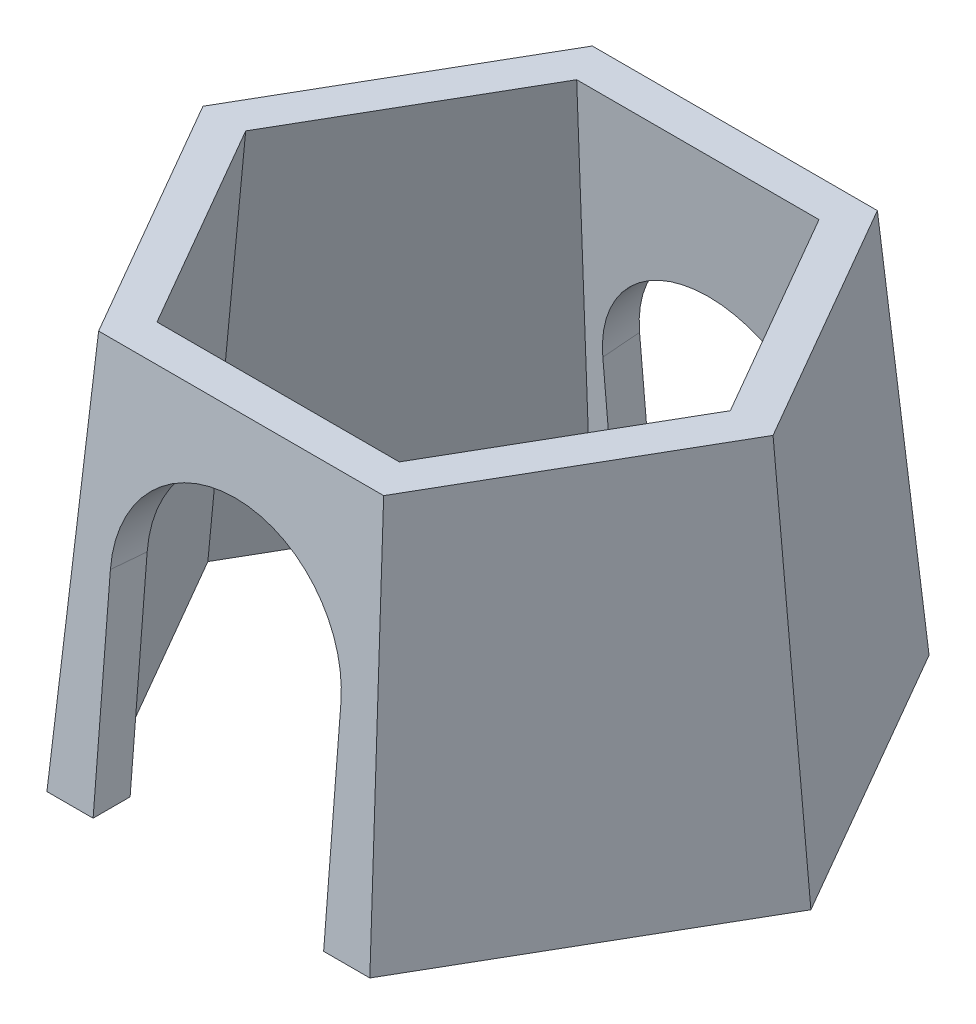
ISO-10303-21;
HEADER;
FILE_DESCRIPTION(('STEP AP214'),'2;1');
FILE_NAME('part.step','',(''),(''),'','','');
FILE_SCHEMA(('AUTOMOTIVE_DESIGN { 1 0 10303 214 1 1 1 1 }'));
ENDSEC;
DATA;
#1=APPLICATION_CONTEXT('core data for automotive mechanical design processes');
#2=APPLICATION_PROTOCOL_DEFINITION('international standard','automotive_design',2000,#1);
#3=PRODUCT_CONTEXT('',#1,'mechanical');
#4=PRODUCT('Part','Part','',(#3));
#5=PRODUCT_RELATED_PRODUCT_CATEGORY('part','',(#4));
#6=PRODUCT_DEFINITION_FORMATION('','',#4);
#7=PRODUCT_DEFINITION_CONTEXT('part definition',#1,'design');
#8=PRODUCT_DEFINITION('design','',#6,#7);
#9=PRODUCT_DEFINITION_SHAPE('','',#8);
#10=(LENGTH_UNIT() NAMED_UNIT(*) SI_UNIT(.MILLI.,.METRE.));
#11=(NAMED_UNIT(*) PLANE_ANGLE_UNIT() SI_UNIT($,.RADIAN.));
#12=(NAMED_UNIT(*) SI_UNIT($,.STERADIAN.) SOLID_ANGLE_UNIT());
#13=UNCERTAINTY_MEASURE_WITH_UNIT(LENGTH_MEASURE(1.E-05),#10,'distance_accuracy_value','');
#14=(GEOMETRIC_REPRESENTATION_CONTEXT(3) GLOBAL_UNCERTAINTY_ASSIGNED_CONTEXT((#13)) GLOBAL_UNIT_ASSIGNED_CONTEXT((#10,
#11,#12)) REPRESENTATION_CONTEXT('',''));
#15=CARTESIAN_POINT('',(0.,0.,0.));
#16=DIRECTION('',(0.,0.,1.));
#17=DIRECTION('',(1.,0.,0.));
#18=AXIS2_PLACEMENT_3D('',#15,#16,#17);
#19=CARTESIAN_POINT('',(0.,115.,0.));
#20=DIRECTION('',(0.,1.,0.));
#21=DIRECTION('',(0.,0.,1.));
#22=AXIS2_PLACEMENT_3D('',#19,#20,#21);
#23=PLANE('',#22);
#24=DIRECTION('',(0.,0.,-1.));
#25=VECTOR('',#24,1.);
#26=CARTESIAN_POINT('',(25.,115.,0.));
#27=LINE('',#26,#25);
#28=CARTESIAN_POINT('',(25.,115.,60.6497063949803));
#29=VERTEX_POINT('',#28);
#30=CARTESIAN_POINT('',(25.,115.,52.6217782649107));
#31=VERTEX_POINT('',#30);
#32=EDGE_CURVE('E435',#29,#31,#27,.T.);
#33=ORIENTED_EDGE('',*,*,#32,.T.);
#34=DIRECTION('',(1.,0.,0.));
#35=VECTOR('',#34,1.);
#36=CARTESIAN_POINT('',(-30.381197846483,115.,52.6217782649107));
#37=LINE('',#36,#35);
#38=CARTESIAN_POINT('',(30.381197846483,115.,52.6217782649107));
#39=VERTEX_POINT('',#38);
#40=EDGE_CURVE('E350',#31,#39,#37,.T.);
#41=ORIENTED_EDGE('',*,*,#40,.T.);
#42=DIRECTION('',(0.499999999999999,0.,-0.866025403784439));
#43=VECTOR('',#42,1.);
#44=CARTESIAN_POINT('',(30.381197846483,115.,52.6217782649107));
#45=LINE('',#44,#43);
#46=CARTESIAN_POINT('',(60.7623956929659,115.,0.));
#47=VERTEX_POINT('',#46);
#48=EDGE_CURVE('E340',#39,#47,#45,.T.);
#49=ORIENTED_EDGE('',*,*,#48,.T.);
#50=DIRECTION('',(-0.5,0.,-0.866025403784438));
#51=VECTOR('',#50,1.);
#52=CARTESIAN_POINT('',(60.7623956929659,115.,0.));
#53=LINE('',#52,#51);
#54=CARTESIAN_POINT('',(30.3811978464829,115.,-52.6217782649107));
#55=VERTEX_POINT('',#54);
#56=EDGE_CURVE('E335',#47,#55,#53,.T.);
#57=ORIENTED_EDGE('',*,*,#56,.T.);
#58=DIRECTION('',(-1.,0.,0.));
#59=VECTOR('',#58,1.);
#60=CARTESIAN_POINT('',(30.3811978464829,115.,-52.6217782649107));
#61=LINE('',#60,#59);
#62=CARTESIAN_POINT('',(24.8905136624591,115.,-52.6217782649107));
#63=VERTEX_POINT('',#62);
#64=EDGE_CURVE('E334',#55,#63,#61,.T.);
#65=ORIENTED_EDGE('',*,*,#64,.T.);
#66=DIRECTION('',(0.,0.,-1.));
#67=VECTOR('',#66,1.);
#68=CARTESIAN_POINT('',(24.8905136624591,115.,0.));
#69=LINE('',#68,#67);
#70=CARTESIAN_POINT('',(24.8905136624591,115.,-60.6497063949804));
#71=VERTEX_POINT('',#70);
#72=EDGE_CURVE('E495',#63,#71,#69,.T.);
#73=ORIENTED_EDGE('',*,*,#72,.T.);
#74=DIRECTION('',(-1.,0.,0.));
#75=VECTOR('',#74,1.);
#76=CARTESIAN_POINT('',(0.,115.,-60.6497063949803));
#77=LINE('',#76,#75);
#78=CARTESIAN_POINT('',(35.0161243134136,115.,-60.6497063949803));
#79=VERTEX_POINT('',#78);
#80=EDGE_CURVE('E412',#79,#71,#77,.T.);
#81=ORIENTED_EDGE('',*,*,#80,.F.);
#82=DIRECTION('',(-0.5,0.,-0.866025403784438));
#83=VECTOR('',#82,1.);
#84=CARTESIAN_POINT('',(52.5241864701205,115.,-30.3248531974902));
#85=LINE('',#84,#83);
#86=CARTESIAN_POINT('',(70.0322486268273,115.,0.));
#87=VERTEX_POINT('',#86);
#88=EDGE_CURVE('E415',#87,#79,#85,.T.);
#89=ORIENTED_EDGE('',*,*,#88,.F.);
#90=DIRECTION('',(0.5,0.,-0.866025403784439));
#91=VECTOR('',#90,1.);
#92=CARTESIAN_POINT('',(52.5241864701205,115.,30.3248531974901));
#93=LINE('',#92,#91);
#94=CARTESIAN_POINT('',(35.0161243134136,115.,60.6497063949803));
#95=VERTEX_POINT('',#94);
#96=EDGE_CURVE('E354',#95,#87,#93,.T.);
#97=ORIENTED_EDGE('',*,*,#96,.F.);
#98=DIRECTION('',(1.,0.,0.));
#99=VECTOR('',#98,1.);
#100=CARTESIAN_POINT('',(0.,115.,60.6497063949803));
#101=LINE('',#100,#99);
#102=EDGE_CURVE('E405',#29,#95,#101,.T.);
#103=ORIENTED_EDGE('',*,*,#102,.F.);
#104=EDGE_LOOP('',(#33,#41,#49,#57,#65,#73,#81,#89,#97,#103));
#105=FACE_BOUND('',#104,.T.);
#106=ADVANCED_FACE('F171',(#105),#23,.F.);
#107=CARTESIAN_POINT('',(-30.3811978464826,115.,52.6217782649113));
#108=VERTEX_POINT('',#107);
#109=CARTESIAN_POINT('',(-25.,115.,52.6217782649107));
#110=VERTEX_POINT('',#109);
#111=EDGE_CURVE('E353',#108,#110,#37,.T.);
#112=ORIENTED_EDGE('',*,*,#111,.T.);
#113=DIRECTION('',(0.,0.,1.));
#114=VECTOR('',#113,1.);
#115=CARTESIAN_POINT('',(-25.,115.,0.));
#116=LINE('',#115,#114);
#117=CARTESIAN_POINT('',(-25.,115.,60.6497063949804));
#118=VERTEX_POINT('',#117);
#119=EDGE_CURVE('E377',#110,#118,#116,.T.);
#120=ORIENTED_EDGE('',*,*,#119,.T.);
#121=CARTESIAN_POINT('',(-35.0161243134136,115.,60.6497063949803));
#122=VERTEX_POINT('',#121);
#123=EDGE_CURVE('E402',#122,#118,#101,.T.);
#124=ORIENTED_EDGE('',*,*,#123,.F.);
#125=DIRECTION('',(0.5,0.,0.866025403784438));
#126=VECTOR('',#125,1.);
#127=CARTESIAN_POINT('',(-52.5241864701204,115.,30.3248531974902));
#128=LINE('',#127,#126);
#129=CARTESIAN_POINT('',(-70.0322486268273,115.,0.));
#130=VERTEX_POINT('',#129);
#131=EDGE_CURVE('E406',#130,#122,#128,.T.);
#132=ORIENTED_EDGE('',*,*,#131,.F.);
#133=DIRECTION('',(-0.5,0.,0.866025403784439));
#134=VECTOR('',#133,1.);
#135=CARTESIAN_POINT('',(-52.5241864701204,115.,-30.3248531974901));
#136=LINE('',#135,#134);
#137=CARTESIAN_POINT('',(-35.0161243134136,115.,-60.6497063949803));
#138=VERTEX_POINT('',#137);
#139=EDGE_CURVE('E409',#138,#130,#136,.T.);
#140=ORIENTED_EDGE('',*,*,#139,.F.);
#141=CARTESIAN_POINT('',(-25.1094863375409,115.,-60.6497063949803));
#142=VERTEX_POINT('',#141);
#143=EDGE_CURVE('E314',#142,#138,#77,.T.);
#144=ORIENTED_EDGE('',*,*,#143,.F.);
#145=DIRECTION('',(0.,0.,1.));
#146=VECTOR('',#145,1.);
#147=CARTESIAN_POINT('',(-25.1094863375409,115.,0.));
#148=LINE('',#147,#146);
#149=CARTESIAN_POINT('',(-25.1094863375409,115.,-52.6217782649107));
#150=VERTEX_POINT('',#149);
#151=EDGE_CURVE('E306',#142,#150,#148,.T.);
#152=ORIENTED_EDGE('',*,*,#151,.T.);
#153=CARTESIAN_POINT('',(-30.3811978464837,115.,-52.6217782649107));
#154=VERTEX_POINT('',#153);
#155=EDGE_CURVE('E311',#150,#154,#61,.T.);
#156=ORIENTED_EDGE('',*,*,#155,.T.);
#157=DIRECTION('',(-0.5,0.,0.866025403784439));
#158=VECTOR('',#157,1.);
#159=CARTESIAN_POINT('',(-30.381197846483,115.,-52.6217782649107));
#160=LINE('',#159,#158);
#161=CARTESIAN_POINT('',(-60.7623956929663,115.,6.48786580015326E-13));
#162=VERTEX_POINT('',#161);
#163=EDGE_CURVE('E338',#154,#162,#160,.T.);
#164=ORIENTED_EDGE('',*,*,#163,.T.);
#165=DIRECTION('',(0.5,0.,0.866025403784439));
#166=VECTOR('',#165,1.);
#167=CARTESIAN_POINT('',(-60.762395692966,115.,0.));
#168=LINE('',#167,#166);
#169=EDGE_CURVE('E359',#162,#108,#168,.T.);
#170=ORIENTED_EDGE('',*,*,#169,.T.);
#171=EDGE_LOOP('',(#112,#120,#124,#132,#140,#144,#152,#156,#164,#170));
#172=FACE_BOUND('',#171,.T.);
#173=ADVANCED_FACE('F309',(#172),#23,.F.);
#174=CARTESIAN_POINT('',(0.,5.83574179699663,69.7792717812525));
#175=DIRECTION('',(0.,-0.0833405086202502,-0.996521128538135));
#176=DIRECTION('',(0.,0.996521128538135,-0.0833405086202502));
#177=AXIS2_PLACEMENT_3D('',#174,#175,#176);
#178=PLANE('',#177);
#179=DIRECTION('',(-0.0480610614431169,0.995369548204004,-0.0832442002851682));
#180=VECTOR('',#179,1.);
#181=CARTESIAN_POINT('',(40.1940236023456,7.76301602348197,69.6180910398851));
#182=LINE('',#181,#180);
#183=CARTESIAN_POINT('',(30.9119298159669,200.,53.5410330012579));
#184=VERTEX_POINT('',#183);
#185=EDGE_CURVE('E400',#95,#184,#182,.T.);
#186=ORIENTED_EDGE('',*,*,#185,.T.);
#187=DIRECTION('',(-1.,0.,0.));
#188=VECTOR('',#187,1.);
#189=CARTESIAN_POINT('',(0.,200.,53.5410330012579));
#190=LINE('',#189,#188);
#191=CARTESIAN_POINT('',(-30.9119298159669,200.,53.5410330012579));
#192=VERTEX_POINT('',#191);
#193=EDGE_CURVE('E483',#184,#192,#190,.T.);
#194=ORIENTED_EDGE('',*,*,#193,.T.);
#195=DIRECTION('',(0.0480610614431169,0.995369548204004,-0.0832442002851682));
#196=VECTOR('',#195,1.);
#197=CARTESIAN_POINT('',(-40.1940236023455,7.76301602348197,69.6180910398851));
#198=LINE('',#197,#196);
#199=EDGE_CURVE('E418',#122,#192,#198,.T.);
#200=ORIENTED_EDGE('',*,*,#199,.F.);
#201=ORIENTED_EDGE('',*,*,#123,.T.);
#202=DIRECTION('',(0.,-0.996521128538135,0.0833405086202502));
#203=VECTOR('',#202,1.);
#204=CARTESIAN_POINT('',(-25.,115.,60.6497063949804));
#205=LINE('',#204,#203);
#206=CARTESIAN_POINT('',(-25.,159.843450784216,56.8993835070691));
#207=VERTEX_POINT('',#206);
#208=EDGE_CURVE('E318',#207,#118,#205,.T.);
#209=ORIENTED_EDGE('',*,*,#208,.F.);
#210=CARTESIAN_POINT('',(0.,159.843450784216,56.8993835070691));
#211=DIRECTION('',(0.,0.0833405086202502,0.996521128538135));
#212=DIRECTION('',(0.,0.996521128538135,-0.0833405086202502));
#213=AXIS2_PLACEMENT_3D('',#210,#211,#212);
#214=CIRCLE('',#213,25.);
#215=CARTESIAN_POINT('',(25.,159.843450784216,56.8993835070691));
#216=VERTEX_POINT('',#215);
#217=EDGE_CURVE('E504',#216,#207,#214,.T.);
#218=ORIENTED_EDGE('',*,*,#217,.F.);
#219=DIRECTION('',(0.,0.996521128538135,-0.0833405086202502));
#220=VECTOR('',#219,1.);
#221=CARTESIAN_POINT('',(25.,115.,60.6497063949804));
#222=LINE('',#221,#220);
#223=EDGE_CURVE('E501',#29,#216,#222,.T.);
#224=ORIENTED_EDGE('',*,*,#223,.F.);
#225=ORIENTED_EDGE('',*,*,#102,.T.);
#226=EDGE_LOOP('',(#186,#194,#200,#201,#209,#218,#224,#225));
#227=FACE_BOUND('',#226,.T.);
#228=ADVANCED_FACE('F553',(#227),#178,.F.);
#229=CARTESIAN_POINT('',(-60.4306220201432,5.83574179699663,34.8896358906263));
#230=DIRECTION('',(0.863012612721963,-0.0833405086202502,-0.498260564269068));
#231=DIRECTION('',(-0.5,0.,-0.866025403784438));
#232=AXIS2_PLACEMENT_3D('',#229,#230,#231);
#233=PLANE('',#232);
#234=ORIENTED_EDGE('',*,*,#199,.T.);
#235=DIRECTION('',(-0.5,0.,-0.866025403784438));
#236=VECTOR('',#235,1.);
#237=CARTESIAN_POINT('',(-46.3678947239503,200.,26.770516500629));
#238=LINE('',#237,#236);
#239=CARTESIAN_POINT('',(-61.8238596319338,200.,0.));
#240=VERTEX_POINT('',#239);
#241=EDGE_CURVE('E480',#192,#240,#238,.T.);
#242=ORIENTED_EDGE('',*,*,#241,.T.);
#243=DIRECTION('',(0.0961221228862338,0.995369548204004,0.));
#244=VECTOR('',#243,1.);
#245=CARTESIAN_POINT('',(-80.3880472046911,7.76301602348196,0.));
#246=LINE('',#245,#244);
#247=EDGE_CURVE('E390',#130,#240,#246,.T.);
#248=ORIENTED_EDGE('',*,*,#247,.F.);
#249=ORIENTED_EDGE('',*,*,#131,.T.);
#250=EDGE_LOOP('',(#234,#242,#248,#249));
#251=FACE_BOUND('',#250,.T.);
#252=ADVANCED_FACE('F550',(#251),#233,.F.);
#253=CARTESIAN_POINT('',(60.4306220201432,5.83574179699663,34.8896358906262));
#254=DIRECTION('',(-0.863012612721963,-0.0833405086202501,-0.498260564269067));
#255=DIRECTION('',(-0.5,0.,0.866025403784439));
#256=AXIS2_PLACEMENT_3D('',#253,#254,#255);
#257=PLANE('',#256);
#258=DIRECTION('',(-0.0961221228862339,0.995369548204004,0.));
#259=VECTOR('',#258,1.);
#260=CARTESIAN_POINT('',(80.3880472046911,7.76301602348196,0.));
#261=LINE('',#260,#259);
#262=CARTESIAN_POINT('',(61.8238596319338,200.,0.));
#263=VERTEX_POINT('',#262);
#264=EDGE_CURVE('E397',#87,#263,#261,.T.);
#265=ORIENTED_EDGE('',*,*,#264,.T.);
#266=DIRECTION('',(-0.5,0.,0.866025403784439));
#267=VECTOR('',#266,1.);
#268=CARTESIAN_POINT('',(46.3678947239503,200.,26.770516500629));
#269=LINE('',#268,#267);
#270=EDGE_CURVE('E477',#263,#184,#269,.T.);
#271=ORIENTED_EDGE('',*,*,#270,.T.);
#272=ORIENTED_EDGE('',*,*,#185,.F.);
#273=ORIENTED_EDGE('',*,*,#96,.T.);
#274=EDGE_LOOP('',(#265,#271,#272,#273));
#275=FACE_BOUND('',#274,.T.);
#276=ADVANCED_FACE('F530',(#275),#257,.F.);
#277=CARTESIAN_POINT('',(60.4306220201432,5.83574179699663,-34.8896358906262));
#278=DIRECTION('',(-0.863012612721963,-0.0833405086202501,0.498260564269068));
#279=DIRECTION('',(0.5,0.,0.866025403784438));
#280=AXIS2_PLACEMENT_3D('',#277,#278,#279);
#281=PLANE('',#280);
#282=DIRECTION('',(-0.0480610614431169,0.995369548204004,0.0832442002851682));
#283=VECTOR('',#282,1.);
#284=CARTESIAN_POINT('',(40.1940236023455,7.76301602348197,-69.6180910398851));
#285=LINE('',#284,#283);
#286=CARTESIAN_POINT('',(30.9119298159669,200.,-53.5410330012579));
#287=VERTEX_POINT('',#286);
#288=EDGE_CURVE('E401',#79,#287,#285,.T.);
#289=ORIENTED_EDGE('',*,*,#288,.T.);
#290=DIRECTION('',(0.5,0.,0.866025403784438));
#291=VECTOR('',#290,1.);
#292=CARTESIAN_POINT('',(46.3678947239503,200.,-26.770516500629));
#293=LINE('',#292,#291);
#294=EDGE_CURVE('E474',#287,#263,#293,.T.);
#295=ORIENTED_EDGE('',*,*,#294,.T.);
#296=ORIENTED_EDGE('',*,*,#264,.F.);
#297=ORIENTED_EDGE('',*,*,#88,.T.);
#298=EDGE_LOOP('',(#289,#295,#296,#297));
#299=FACE_BOUND('',#298,.T.);
#300=ADVANCED_FACE('F528',(#299),#281,.F.);
#301=CARTESIAN_POINT('',(0.,5.83574179699663,-69.7792717812525));
#302=DIRECTION('',(0.,-0.0833405086202501,0.996521128538135));
#303=DIRECTION('',(0.,-0.996521128538135,-0.0833405086202501));
#304=AXIS2_PLACEMENT_3D('',#301,#302,#303);
#305=PLANE('',#304);
#306=DIRECTION('',(0.0480610614431168,0.995369548204004,0.0832442002851681));
#307=VECTOR('',#306,1.);
#308=CARTESIAN_POINT('',(-40.1940236023455,7.76301602348196,-69.6180910398851));
#309=LINE('',#308,#307);
#310=CARTESIAN_POINT('',(-30.9119298159669,200.,-53.5410330012579));
#311=VERTEX_POINT('',#310);
#312=EDGE_CURVE('E396',#138,#311,#309,.T.);
#313=ORIENTED_EDGE('',*,*,#312,.T.);
#314=DIRECTION('',(1.,0.,0.));
#315=VECTOR('',#314,1.);
#316=CARTESIAN_POINT('',(0.,200.,-53.5410330012579));
#317=LINE('',#316,#315);
#318=EDGE_CURVE('E186',#311,#287,#317,.T.);
#319=ORIENTED_EDGE('',*,*,#318,.T.);
#320=ORIENTED_EDGE('',*,*,#288,.F.);
#321=ORIENTED_EDGE('',*,*,#80,.T.);
#322=DIRECTION('',(0.,-0.996521128538135,-0.0833405086202499));
#323=VECTOR('',#322,1.);
#324=CARTESIAN_POINT('',(24.8905136624591,115.,-60.6497063949804));
#325=LINE('',#324,#323);
#326=CARTESIAN_POINT('',(24.8905136624591,146.88867611322,-57.9828101191324));
#327=VERTEX_POINT('',#326);
#328=EDGE_CURVE('E491',#327,#71,#325,.T.);
#329=ORIENTED_EDGE('',*,*,#328,.F.);
#330=CARTESIAN_POINT('',(-0.109486337540935,146.88867611322,-57.9828101191324));
#331=DIRECTION('',(0.,0.0833405086202502,-0.996521128538135));
#332=DIRECTION('',(0.,-0.996521128538135,-0.0833405086202502));
#333=AXIS2_PLACEMENT_3D('',#330,#331,#332);
#334=CIRCLE('',#333,25.);
#335=CARTESIAN_POINT('',(-25.1094863375409,146.88867611322,-57.9828101191323));
#336=VERTEX_POINT('',#335);
#337=EDGE_CURVE('E488',#336,#327,#334,.T.);
#338=ORIENTED_EDGE('',*,*,#337,.F.);
#339=DIRECTION('',(0.,0.996521128538135,0.0833405086202501));
#340=VECTOR('',#339,1.);
#341=CARTESIAN_POINT('',(-25.1094863375409,115.,-60.6497063949803));
#342=LINE('',#341,#340);
#343=EDGE_CURVE('E486',#142,#336,#342,.T.);
#344=ORIENTED_EDGE('',*,*,#343,.F.);
#345=ORIENTED_EDGE('',*,*,#143,.T.);
#346=EDGE_LOOP('',(#313,#319,#320,#321,#329,#338,#344,#345));
#347=FACE_BOUND('',#346,.T.);
#348=ADVANCED_FACE('F535',(#347),#305,.F.);
#349=CARTESIAN_POINT('',(-60.4306220201432,5.83574179699662,-34.8896358906262));
#350=DIRECTION('',(0.863012612721963,-0.08334050862025,0.498260564269067));
#351=DIRECTION('',(0.5,0.,-0.866025403784439));
#352=AXIS2_PLACEMENT_3D('',#349,#350,#351);
#353=PLANE('',#352);
#354=ORIENTED_EDGE('',*,*,#247,.T.);
#355=DIRECTION('',(0.5,0.,-0.866025403784439));
#356=VECTOR('',#355,1.);
#357=CARTESIAN_POINT('',(-46.3678947239503,200.,-26.7705165006289));
#358=LINE('',#357,#356);
#359=EDGE_CURVE('E471',#240,#311,#358,.T.);
#360=ORIENTED_EDGE('',*,*,#359,.T.);
#361=ORIENTED_EDGE('',*,*,#312,.F.);
#362=ORIENTED_EDGE('',*,*,#139,.T.);
#363=EDGE_LOOP('',(#354,#360,#361,#362));
#364=FACE_BOUND('',#363,.T.);
#365=ADVANCED_FACE('F173',(#364),#353,.F.);
#366=CARTESIAN_POINT('',(0.,5.16901772803463,61.8071027529474));
#367=DIRECTION('',(0.,-0.0833405086202502,-0.996521128538135));
#368=DIRECTION('',(0.,0.996521128538135,-0.0833405086202502));
#369=AXIS2_PLACEMENT_3D('',#366,#367,#368);
#370=PLANE('',#369);
#371=DIRECTION('',(-1.,0.,0.));
#372=VECTOR('',#371,1.);
#373=CARTESIAN_POINT('',(0.,200.,45.5131048711883));
#374=LINE('',#373,#372);
#375=CARTESIAN_POINT('',(26.2770033490365,200.,45.5131048711882));
#376=VERTEX_POINT('',#375);
#377=CARTESIAN_POINT('',(-26.277003349036,200.,45.5131048711887));
#378=VERTEX_POINT('',#377);
#379=EDGE_CURVE('E469',#376,#378,#374,.T.);
#380=ORIENTED_EDGE('',*,*,#379,.F.);
#381=DIRECTION('',(-0.0480610614431203,0.995369548204004,-0.0832442002851682));
#382=VECTOR('',#381,1.);
#383=CARTESIAN_POINT('',(30.3811978464837,115.,52.6217782649107));
#384=LINE('',#383,#382);
#385=EDGE_CURVE('E391',#39,#376,#384,.T.);
#386=ORIENTED_EDGE('',*,*,#385,.F.);
#387=ORIENTED_EDGE('',*,*,#40,.F.);
#388=DIRECTION('',(0.,-0.996521128538135,0.0833405086202502));
#389=VECTOR('',#388,1.);
#390=CARTESIAN_POINT('',(25.,5.16901772803463,61.8071027529474));
#391=LINE('',#390,#389);
#392=CARTESIAN_POINT('',(25.,159.176726715254,48.927214478764));
#393=VERTEX_POINT('',#392);
#394=EDGE_CURVE('E437',#393,#31,#391,.T.);
#395=ORIENTED_EDGE('',*,*,#394,.F.);
#396=CARTESIAN_POINT('',(0.,159.176726715254,48.927214478764));
#397=DIRECTION('',(0.,-0.0833405086202502,-0.996521128538135));
#398=DIRECTION('',(0.,0.996521128538135,-0.0833405086202502));
#399=AXIS2_PLACEMENT_3D('',#396,#397,#398);
#400=CIRCLE('',#399,25.);
#401=CARTESIAN_POINT('',(-25.,159.176726715254,48.927214478764));
#402=VERTEX_POINT('',#401);
#403=EDGE_CURVE('E345',#402,#393,#400,.T.);
#404=ORIENTED_EDGE('',*,*,#403,.F.);
#405=DIRECTION('',(0.,0.996521128538135,-0.0833405086202502));
#406=VECTOR('',#405,1.);
#407=CARTESIAN_POINT('',(-25.,5.16901772803463,61.8071027529474));
#408=LINE('',#407,#406);
#409=EDGE_CURVE('E382',#110,#402,#408,.T.);
#410=ORIENTED_EDGE('',*,*,#409,.F.);
#411=ORIENTED_EDGE('',*,*,#111,.F.);
#412=DIRECTION('',(0.0480610614431152,0.995369548204004,-0.0832442002851711));
#413=VECTOR('',#412,1.);
#414=CARTESIAN_POINT('',(-30.3811978464826,115.,52.6217782649113));
#415=LINE('',#414,#413);
#416=EDGE_CURVE('E375',#108,#378,#415,.T.);
#417=ORIENTED_EDGE('',*,*,#416,.T.);
#418=EDGE_LOOP('',(#380,#386,#387,#395,#404,#410,#411,#417));
#419=FACE_BOUND('',#418,.T.);
#420=ADVANCED_FACE('F431',(#419),#370,.T.);
#421=CARTESIAN_POINT('',(-53.5265211183675,5.16901772803463,30.9035513764737));
#422=DIRECTION('',(0.863012612721963,-0.0833405086202502,-0.498260564269068));
#423=DIRECTION('',(-0.5,0.,-0.866025403784438));
#424=AXIS2_PLACEMENT_3D('',#421,#422,#423);
#425=PLANE('',#424);
#426=DIRECTION('',(-0.5,0.,-0.866025403784438));
#427=VECTOR('',#426,1.);
#428=CARTESIAN_POINT('',(-39.4155050235543,200.,22.7565524355942));
#429=LINE('',#428,#427);
#430=CARTESIAN_POINT('',(-52.5540066980726,200.,3.90519791167494E-13));
#431=VERTEX_POINT('',#430);
#432=EDGE_CURVE('E193',#378,#431,#429,.T.);
#433=ORIENTED_EDGE('',*,*,#432,.F.);
#434=ORIENTED_EDGE('',*,*,#416,.F.);
#435=ORIENTED_EDGE('',*,*,#169,.F.);
#436=DIRECTION('',(0.0961221228862355,0.995369548204004,0.));
#437=VECTOR('',#436,1.);
#438=CARTESIAN_POINT('',(-60.7623956929663,115.,6.45317133063372E-13));
#439=LINE('',#438,#437);
#440=EDGE_CURVE('E373',#162,#431,#439,.T.);
#441=ORIENTED_EDGE('',*,*,#440,.T.);
#442=EDGE_LOOP('',(#433,#434,#435,#441));
#443=FACE_BOUND('',#442,.T.);
#444=ADVANCED_FACE('F372',(#443),#425,.T.);
#445=CARTESIAN_POINT('',(53.5265211183675,5.16901772803463,30.9035513764737));
#446=DIRECTION('',(-0.863012612721963,-0.0833405086202501,-0.498260564269067));
#447=DIRECTION('',(-0.5,0.,0.866025403784439));
#448=AXIS2_PLACEMENT_3D('',#445,#446,#447);
#449=PLANE('',#448);
#450=DIRECTION('',(-0.5,0.,0.866025403784439));
#451=VECTOR('',#450,1.);
#452=CARTESIAN_POINT('',(39.4155050235544,200.,22.7565524355941));
#453=LINE('',#452,#451);
#454=CARTESIAN_POINT('',(52.5540066980725,200.,-2.95675747812406E-13));
#455=VERTEX_POINT('',#454);
#456=EDGE_CURVE('E463',#455,#376,#453,.T.);
#457=ORIENTED_EDGE('',*,*,#456,.F.);
#458=DIRECTION('',(-0.0961221228862355,0.995369548204004,0.));
#459=VECTOR('',#458,1.);
#460=CARTESIAN_POINT('',(60.7623956929663,115.,-6.34393653578018E-13));
#461=LINE('',#460,#459);
#462=EDGE_CURVE('E443',#47,#455,#461,.T.);
#463=ORIENTED_EDGE('',*,*,#462,.F.);
#464=ORIENTED_EDGE('',*,*,#48,.F.);
#465=ORIENTED_EDGE('',*,*,#385,.T.);
#466=EDGE_LOOP('',(#457,#463,#464,#465));
#467=FACE_BOUND('',#466,.T.);
#468=ADVANCED_FACE('F519',(#467),#449,.T.);
#469=CARTESIAN_POINT('',(53.5265211183675,5.16901772803463,-30.9035513764737));
#470=DIRECTION('',(-0.863012612721963,-0.0833405086202501,0.498260564269068));
#471=DIRECTION('',(0.5,0.,0.866025403784438));
#472=AXIS2_PLACEMENT_3D('',#469,#470,#471);
#473=PLANE('',#472);
#474=DIRECTION('',(0.5,0.,0.866025403784438));
#475=VECTOR('',#474,1.);
#476=CARTESIAN_POINT('',(39.4155050235543,200.,-22.7565524355942));
#477=LINE('',#476,#475);
#478=CARTESIAN_POINT('',(26.277003349036,200.,-45.5131048711885));
#479=VERTEX_POINT('',#478);
#480=EDGE_CURVE('E461',#479,#455,#477,.T.);
#481=ORIENTED_EDGE('',*,*,#480,.F.);
#482=DIRECTION('',(-0.0480610614431154,0.995369548204004,0.0832442002851709));
#483=VECTOR('',#482,1.);
#484=CARTESIAN_POINT('',(30.3811978464826,115.,-52.6217782649113));
#485=LINE('',#484,#483);
#486=EDGE_CURVE('E379',#55,#479,#485,.T.);
#487=ORIENTED_EDGE('',*,*,#486,.F.);
#488=ORIENTED_EDGE('',*,*,#56,.F.);
#489=ORIENTED_EDGE('',*,*,#462,.T.);
#490=EDGE_LOOP('',(#481,#487,#488,#489));
#491=FACE_BOUND('',#490,.T.);
#492=ADVANCED_FACE('F459',(#491),#473,.T.);
#493=CARTESIAN_POINT('',(0.,5.16901772803463,-61.8071027529474));
#494=DIRECTION('',(0.,-0.0833405086202501,0.996521128538135));
#495=DIRECTION('',(0.,-0.996521128538135,-0.0833405086202501));
#496=AXIS2_PLACEMENT_3D('',#493,#494,#495);
#497=PLANE('',#496);
#498=DIRECTION('',(1.,0.,0.));
#499=VECTOR('',#498,1.);
#500=CARTESIAN_POINT('',(0.,200.,-45.5131048711883));
#501=LINE('',#500,#499);
#502=CARTESIAN_POINT('',(-26.2770033490365,200.,-45.5131048711882));
#503=VERTEX_POINT('',#502);
#504=EDGE_CURVE('E455',#503,#479,#501,.T.);
#505=ORIENTED_EDGE('',*,*,#504,.F.);
#506=DIRECTION('',(0.0480610614431202,0.995369548204004,0.0832442002851681));
#507=VECTOR('',#506,1.);
#508=CARTESIAN_POINT('',(-30.3811978464837,115.,-52.6217782649107));
#509=LINE('',#508,#507);
#510=EDGE_CURVE('E332',#154,#503,#509,.T.);
#511=ORIENTED_EDGE('',*,*,#510,.F.);
#512=ORIENTED_EDGE('',*,*,#155,.F.);
#513=DIRECTION('',(0.,-0.996521128538135,-0.0833405086202501));
#514=VECTOR('',#513,1.);
#515=CARTESIAN_POINT('',(-25.1094863375409,5.16901772803463,-61.8071027529474));
#516=LINE('',#515,#514);
#517=CARTESIAN_POINT('',(-25.1094863375409,146.221952044258,-50.0106410908272));
#518=VERTEX_POINT('',#517);
#519=EDGE_CURVE('E319',#518,#150,#516,.T.);
#520=ORIENTED_EDGE('',*,*,#519,.F.);
#521=CARTESIAN_POINT('',(-0.109486337540932,146.221952044258,-50.0106410908272));
#522=DIRECTION('',(0.,-0.0833405086202501,0.996521128538135));
#523=DIRECTION('',(0.,-0.996521128538135,-0.0833405086202501));
#524=AXIS2_PLACEMENT_3D('',#521,#522,#523);
#525=CIRCLE('',#524,25.);
#526=CARTESIAN_POINT('',(24.8905136624591,146.221952044258,-50.0106410908272));
#527=VERTEX_POINT('',#526);
#528=EDGE_CURVE('E179',#527,#518,#525,.T.);
#529=ORIENTED_EDGE('',*,*,#528,.F.);
#530=DIRECTION('',(0.,0.996521128538135,0.0833405086202501));
#531=VECTOR('',#530,1.);
#532=CARTESIAN_POINT('',(24.8905136624591,5.16901772803463,-61.8071027529474));
#533=LINE('',#532,#531);
#534=EDGE_CURVE('E327',#63,#527,#533,.T.);
#535=ORIENTED_EDGE('',*,*,#534,.F.);
#536=ORIENTED_EDGE('',*,*,#64,.F.);
#537=ORIENTED_EDGE('',*,*,#486,.T.);
#538=EDGE_LOOP('',(#505,#511,#512,#520,#529,#535,#536,#537));
#539=FACE_BOUND('',#538,.T.);
#540=ADVANCED_FACE('F330',(#539),#497,.T.);
#541=CARTESIAN_POINT('',(-53.5265211183675,5.16901772803462,-30.9035513764736));
#542=DIRECTION('',(0.863012612721963,-0.08334050862025,0.498260564269067));
#543=DIRECTION('',(0.5,0.,-0.866025403784439));
#544=AXIS2_PLACEMENT_3D('',#541,#542,#543);
#545=PLANE('',#544);
#546=DIRECTION('',(0.5,0.,-0.866025403784439));
#547=VECTOR('',#546,1.);
#548=CARTESIAN_POINT('',(-39.4155050235543,200.,-22.7565524355941));
#549=LINE('',#548,#547);
#550=EDGE_CURVE('E12',#431,#503,#549,.T.);
#551=ORIENTED_EDGE('',*,*,#550,.F.);
#552=ORIENTED_EDGE('',*,*,#440,.F.);
#553=ORIENTED_EDGE('',*,*,#163,.F.);
#554=ORIENTED_EDGE('',*,*,#510,.T.);
#555=EDGE_LOOP('',(#551,#552,#553,#554));
#556=FACE_BOUND('',#555,.T.);
#557=ADVANCED_FACE('F376',(#556),#545,.T.);
#558=CARTESIAN_POINT('',(-25.,114.166594913798,50.684495109599));
#559=DIRECTION('',(-1.,0.,0.));
#560=DIRECTION('',(0.,0.,1.));
#561=AXIS2_PLACEMENT_3D('',#558,#559,#560);
#562=PLANE('',#561);
#563=ORIENTED_EDGE('',*,*,#119,.F.);
#564=ORIENTED_EDGE('',*,*,#409,.T.);
#565=DIRECTION('',(0.,0.0833405086202502,0.996521128538135));
#566=VECTOR('',#565,1.);
#567=CARTESIAN_POINT('',(-25.,159.010045698014,46.9341722216877));
#568=LINE('',#567,#566);
#569=EDGE_CURVE('E508',#402,#207,#568,.T.);
#570=ORIENTED_EDGE('',*,*,#569,.T.);
#571=ORIENTED_EDGE('',*,*,#208,.T.);
#572=EDGE_LOOP('',(#563,#564,#570,#571));
#573=FACE_BOUND('',#572,.T.);
#574=ADVANCED_FACE('F656',(#573),#562,.F.);
#575=CARTESIAN_POINT('',(25.,114.166594913798,50.684495109599));
#576=DIRECTION('',(1.,0.,0.));
#577=DIRECTION('',(0.,0.,-1.));
#578=AXIS2_PLACEMENT_3D('',#575,#576,#577);
#579=PLANE('',#578);
#580=ORIENTED_EDGE('',*,*,#394,.T.);
#581=ORIENTED_EDGE('',*,*,#32,.F.);
#582=ORIENTED_EDGE('',*,*,#223,.T.);
#583=DIRECTION('',(0.,0.0833405086202502,0.996521128538135));
#584=VECTOR('',#583,1.);
#585=CARTESIAN_POINT('',(25.,159.010045698014,46.9341722216877));
#586=LINE('',#585,#584);
#587=EDGE_CURVE('E507',#393,#216,#586,.T.);
#588=ORIENTED_EDGE('',*,*,#587,.F.);
#589=EDGE_LOOP('',(#580,#581,#582,#588));
#590=FACE_BOUND('',#589,.T.);
#591=ADVANCED_FACE('F514',(#590),#579,.F.);
#592=CARTESIAN_POINT('',(0.,159.010045698014,46.9341722216877));
#593=DIRECTION('',(0.,0.0833405086202502,0.996521128538135));
#594=DIRECTION('',(0.,-0.996521128538135,0.0833405086202502));
#595=AXIS2_PLACEMENT_3D('',#592,#593,#594);
#596=CYLINDRICAL_SURFACE('',#595,25.);
#597=ORIENTED_EDGE('',*,*,#403,.T.);
#598=ORIENTED_EDGE('',*,*,#587,.T.);
#599=ORIENTED_EDGE('',*,*,#217,.T.);
#600=ORIENTED_EDGE('',*,*,#569,.F.);
#601=EDGE_LOOP('',(#597,#598,#599,#600));
#602=FACE_BOUND('',#601,.T.);
#603=ADVANCED_FACE('F557',(#602),#596,.F.);
#604=CARTESIAN_POINT('',(24.8905136624591,114.166594913798,-50.684495109599));
#605=DIRECTION('',(1.,0.,0.));
#606=DIRECTION('',(0.,0.,-1.));
#607=AXIS2_PLACEMENT_3D('',#604,#605,#606);
#608=PLANE('',#607);
#609=ORIENTED_EDGE('',*,*,#72,.F.);
#610=ORIENTED_EDGE('',*,*,#534,.T.);
#611=DIRECTION('',(0.,0.0833405086202502,-0.996521128538135));
#612=VECTOR('',#611,1.);
#613=CARTESIAN_POINT('',(24.8905136624591,146.055271027018,-48.017598833751));
#614=LINE('',#613,#612);
#615=EDGE_CURVE('E493',#527,#327,#614,.T.);
#616=ORIENTED_EDGE('',*,*,#615,.T.);
#617=ORIENTED_EDGE('',*,*,#328,.T.);
#618=EDGE_LOOP('',(#609,#610,#616,#617));
#619=FACE_BOUND('',#618,.T.);
#620=ADVANCED_FACE('F562',(#619),#608,.F.);
#621=CARTESIAN_POINT('',(-0.109486337540932,146.055271027018,-48.017598833751));
#622=DIRECTION('',(0.,0.0833405086202502,-0.996521128538135));
#623=DIRECTION('',(0.,0.996521128538135,0.0833405086202502));
#624=AXIS2_PLACEMENT_3D('',#621,#622,#623);
#625=CYLINDRICAL_SURFACE('',#624,25.);
#626=ORIENTED_EDGE('',*,*,#528,.T.);
#627=DIRECTION('',(0.,0.0833405086202502,-0.996521128538135));
#628=VECTOR('',#627,1.);
#629=CARTESIAN_POINT('',(-25.1094863375409,146.055271027018,-48.017598833751));
#630=LINE('',#629,#628);
#631=EDGE_CURVE('E324',#518,#336,#630,.T.);
#632=ORIENTED_EDGE('',*,*,#631,.T.);
#633=ORIENTED_EDGE('',*,*,#337,.T.);
#634=ORIENTED_EDGE('',*,*,#615,.F.);
#635=EDGE_LOOP('',(#626,#632,#633,#634));
#636=FACE_BOUND('',#635,.T.);
#637=ADVANCED_FACE('F560',(#636),#625,.F.);
#638=CARTESIAN_POINT('',(-25.1094863375409,114.166594913798,-50.684495109599));
#639=DIRECTION('',(-1.,0.,0.));
#640=DIRECTION('',(0.,0.,1.));
#641=AXIS2_PLACEMENT_3D('',#638,#639,#640);
#642=PLANE('',#641);
#643=ORIENTED_EDGE('',*,*,#519,.T.);
#644=ORIENTED_EDGE('',*,*,#151,.F.);
#645=ORIENTED_EDGE('',*,*,#343,.T.);
#646=ORIENTED_EDGE('',*,*,#631,.F.);
#647=EDGE_LOOP('',(#643,#644,#645,#646));
#648=FACE_BOUND('',#647,.T.);
#649=ADVANCED_FACE('F323',(#648),#642,.F.);
#650=CARTESIAN_POINT('',(-80.7331805127518,200.,-88.1049886413525));
#651=DIRECTION('',(0.,-1.,0.));
#652=DIRECTION('',(0.,0.,-1.));
#653=AXIS2_PLACEMENT_3D('',#650,#651,#652);
#654=PLANE('',#653);
#655=ORIENTED_EDGE('',*,*,#379,.T.);
#656=ORIENTED_EDGE('',*,*,#432,.T.);
#657=ORIENTED_EDGE('',*,*,#550,.T.);
#658=ORIENTED_EDGE('',*,*,#504,.T.);
#659=ORIENTED_EDGE('',*,*,#480,.T.);
#660=ORIENTED_EDGE('',*,*,#456,.T.);
#661=EDGE_LOOP('',(#655,#656,#657,#658,#659,#660));
#662=FACE_BOUND('',#661,.T.);
#663=ORIENTED_EDGE('',*,*,#270,.F.);
#664=ORIENTED_EDGE('',*,*,#294,.F.);
#665=ORIENTED_EDGE('',*,*,#318,.F.);
#666=ORIENTED_EDGE('',*,*,#359,.F.);
#667=ORIENTED_EDGE('',*,*,#241,.F.);
#668=ORIENTED_EDGE('',*,*,#193,.F.);
#669=EDGE_LOOP('',(#663,#664,#665,#666,#667,#668));
#670=FACE_BOUND('',#669,.T.);
#671=ADVANCED_FACE('F520',(#662,#670),#654,.F.);
#672=CLOSED_SHELL('',(#106,#173,#228,#252,#276,#300,#348,#365,#420,#444,#468,#492,#540,#557,
#574,#591,#603,#620,#637,#649,#671));
#673=MANIFOLD_SOLID_BREP('B2',#672);
#674=ADVANCED_BREP_SHAPE_REPRESENTATION('',(#18,#673),#14);
#675=SHAPE_DEFINITION_REPRESENTATION(#9,#674);
ENDSEC;
END-ISO-10303-21;
